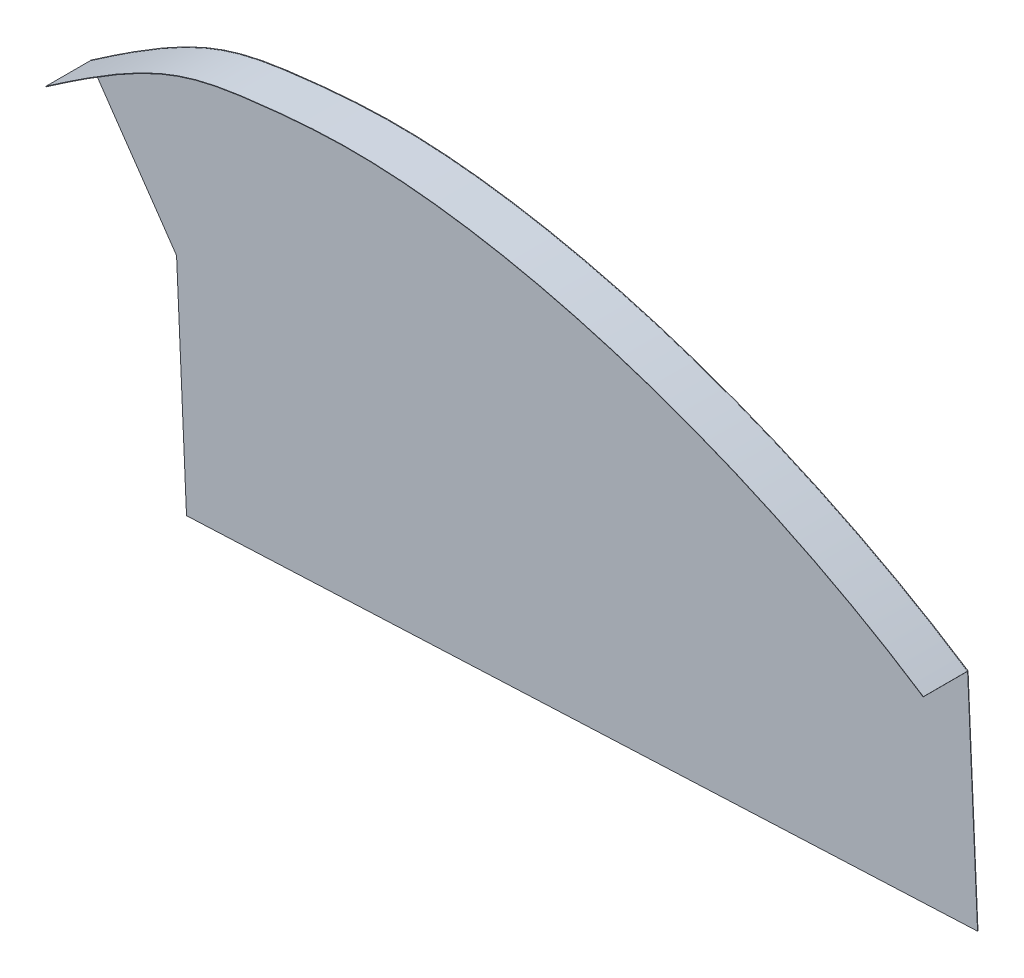
ISO-10303-21;
HEADER;
FILE_DESCRIPTION(('STEP AP214'),'2;1');
FILE_NAME('part.step','',(''),(''),'','','');
FILE_SCHEMA(('AUTOMOTIVE_DESIGN { 1 0 10303 214 1 1 1 1 }'));
ENDSEC;
DATA;
#1=APPLICATION_CONTEXT('core data for automotive mechanical design processes');
#2=APPLICATION_PROTOCOL_DEFINITION('international standard','automotive_design',2000,#1);
#3=PRODUCT_CONTEXT('',#1,'mechanical');
#4=PRODUCT('Part','Part','',(#3));
#5=PRODUCT_RELATED_PRODUCT_CATEGORY('part','',(#4));
#6=PRODUCT_DEFINITION_FORMATION('','',#4);
#7=PRODUCT_DEFINITION_CONTEXT('part definition',#1,'design');
#8=PRODUCT_DEFINITION('design','',#6,#7);
#9=PRODUCT_DEFINITION_SHAPE('','',#8);
#10=(LENGTH_UNIT() NAMED_UNIT(*) SI_UNIT(.MILLI.,.METRE.));
#11=(NAMED_UNIT(*) PLANE_ANGLE_UNIT() SI_UNIT($,.RADIAN.));
#12=(NAMED_UNIT(*) SI_UNIT($,.STERADIAN.) SOLID_ANGLE_UNIT());
#13=UNCERTAINTY_MEASURE_WITH_UNIT(LENGTH_MEASURE(1.E-05),#10,'distance_accuracy_value','');
#14=(GEOMETRIC_REPRESENTATION_CONTEXT(3) GLOBAL_UNCERTAINTY_ASSIGNED_CONTEXT((#13)) GLOBAL_UNIT_ASSIGNED_CONTEXT((#10,
#11,#12)) REPRESENTATION_CONTEXT('',''));
#15=CARTESIAN_POINT('',(0.,0.,0.));
#16=DIRECTION('',(0.,0.,1.));
#17=DIRECTION('',(1.,0.,0.));
#18=AXIS2_PLACEMENT_3D('',#15,#16,#17);
#19=CARTESIAN_POINT('',(-1544.64995665935,573.441433080312,0.1));
#20=CARTESIAN_POINT('',(-1585.71664888804,600.423930322912,0.1));
#21=CARTESIAN_POINT('',(-1646.28028973819,619.241808081414,0.1));
#22=CARTESIAN_POINT('',(-1709.38954114273,613.399774738818,0.1));
#23=CARTESIAN_POINT('',(-1719.50790421298,610.537812827554,0.1));
#24=CARTESIAN_POINT('',(-1743.60796018332,593.83047017767,0.1));
#25=B_SPLINE_CURVE_WITH_KNOTS('',3,(#19,#20,#21,#22,#23,#24),.UNSPECIFIED.,.F.,.F.,(4,1,1,4),
(0.,0.579445357910707,0.679445357910707,1.),.UNSPECIFIED.);
#26=DIRECTION('',(0.,0.,-1.));
#27=VECTOR('',#26,1.);
#28=SURFACE_OF_LINEAR_EXTRUSION('',#25,#27);
#29=CARTESIAN_POINT('',(-1544.64995665935,573.441433080312,0.));
#30=CARTESIAN_POINT('',(-1585.71664888804,600.423930322912,0.));
#31=CARTESIAN_POINT('',(-1646.28028973819,619.241808081414,0.));
#32=CARTESIAN_POINT('',(-1709.38954114273,613.399774738818,0.));
#33=CARTESIAN_POINT('',(-1719.50790421298,610.537812827554,0.));
#34=CARTESIAN_POINT('',(-1743.60796018332,593.83047017767,0.));
#35=B_SPLINE_CURVE_WITH_KNOTS('',3,(#29,#30,#31,#32,#33,#34),.UNSPECIFIED.,.F.,.F.,(4,1,1,4),
(0.,0.579445357910707,0.679445357910707,1.),.UNSPECIFIED.);
#36=CARTESIAN_POINT('',(-1544.64995665935,573.441433080312,0.));
#37=VERTEX_POINT('',#36);
#38=CARTESIAN_POINT('',(-1743.60796018332,593.83047017767,0.));
#39=VERTEX_POINT('',#38);
#40=EDGE_CURVE('E110',#37,#39,#35,.T.);
#41=ORIENTED_EDGE('',*,*,#40,.T.);
#42=DIRECTION('',(0.,0.,-1.));
#43=VECTOR('',#42,1.);
#44=CARTESIAN_POINT('',(-1743.60796018332,593.83047017767,0.1));
#45=LINE('',#44,#43);
#46=CARTESIAN_POINT('',(-1743.60796018332,593.83047017767,0.1));
#47=VERTEX_POINT('',#46);
#48=EDGE_CURVE('E11',#47,#39,#45,.T.);
#49=ORIENTED_EDGE('',*,*,#48,.F.);
#50=CARTESIAN_POINT('',(-1544.64995665935,573.441433080312,0.1));
#51=VERTEX_POINT('',#50);
#52=EDGE_CURVE('E191',#51,#47,#25,.T.);
#53=ORIENTED_EDGE('',*,*,#52,.F.);
#54=DIRECTION('',(0.,0.,-1.));
#55=VECTOR('',#54,1.);
#56=CARTESIAN_POINT('',(-1544.64995665935,573.441433080312,0.1));
#57=LINE('',#56,#55);
#58=EDGE_CURVE('E192',#51,#37,#57,.T.);
#59=ORIENTED_EDGE('',*,*,#58,.T.);
#60=EDGE_LOOP('',(#41,#49,#53,#59));
#61=FACE_BOUND('',#60,.T.);
#62=ADVANCED_FACE('F32',(#61),#28,.F.);
#63=CARTESIAN_POINT('',(-1743.60796018332,593.83047017767,0.1));
#64=DIRECTION('',(0.823299571310856,0.567607096396232,0.));
#65=DIRECTION('',(-0.567607096396232,0.823299571310856,0.));
#66=AXIS2_PLACEMENT_3D('',#63,#64,#65);
#67=PLANE('',#66);
#68=DIRECTION('',(0.567607096396232,-0.823299571310856,0.));
#69=VECTOR('',#68,1.);
#70=CARTESIAN_POINT('',(-1743.60796018332,593.83047017767,0.));
#71=LINE('',#70,#69);
#72=CARTESIAN_POINT('',(-1723.97557604015,565.354199265099,0.));
#73=VERTEX_POINT('',#72);
#74=EDGE_CURVE('E169',#39,#73,#71,.T.);
#75=ORIENTED_EDGE('',*,*,#74,.T.);
#76=DIRECTION('',(0.,0.,-1.));
#77=VECTOR('',#76,1.);
#78=CARTESIAN_POINT('',(-1723.97557604015,565.354199265099,0.1));
#79=LINE('',#78,#77);
#80=CARTESIAN_POINT('',(-1723.97557604015,565.354199265099,0.1));
#81=VERTEX_POINT('',#80);
#82=EDGE_CURVE('E40',#81,#73,#79,.T.);
#83=ORIENTED_EDGE('',*,*,#82,.F.);
#84=DIRECTION('',(0.567607096396232,-0.823299571310856,0.));
#85=VECTOR('',#84,1.);
#86=CARTESIAN_POINT('',(-1743.60796018332,593.83047017767,0.1));
#87=LINE('',#86,#85);
#88=EDGE_CURVE('E206',#47,#81,#87,.T.);
#89=ORIENTED_EDGE('',*,*,#88,.F.);
#90=ORIENTED_EDGE('',*,*,#48,.T.);
#91=EDGE_LOOP('',(#75,#83,#89,#90));
#92=FACE_BOUND('',#91,.T.);
#93=ADVANCED_FACE('F160',(#92),#67,.F.);
#94=CARTESIAN_POINT('',(-1723.97557604015,565.354199265099,0.1));
#95=DIRECTION('',(0.998984631984055,0.0450522481090854,0.));
#96=DIRECTION('',(-0.0450522481090854,0.998984631984055,0.));
#97=AXIS2_PLACEMENT_3D('',#94,#95,#96);
#98=PLANE('',#97);
#99=DIRECTION('',(0.0450522481090854,-0.998984631984055,0.));
#100=VECTOR('',#99,1.);
#101=CARTESIAN_POINT('',(-1723.97557604015,565.354199265099,0.));
#102=LINE('',#101,#100);
#103=CARTESIAN_POINT('',(-1721.7229636347,515.404967665896,0.));
#104=VERTEX_POINT('',#103);
#105=EDGE_CURVE('E176',#73,#104,#102,.T.);
#106=ORIENTED_EDGE('',*,*,#105,.T.);
#107=DIRECTION('',(0.,0.,-1.));
#108=VECTOR('',#107,1.);
#109=CARTESIAN_POINT('',(-1721.7229636347,515.404967665896,0.1));
#110=LINE('',#109,#108);
#111=CARTESIAN_POINT('',(-1721.7229636347,515.404967665896,0.1));
#112=VERTEX_POINT('',#111);
#113=EDGE_CURVE('E181',#112,#104,#110,.T.);
#114=ORIENTED_EDGE('',*,*,#113,.F.);
#115=DIRECTION('',(0.0450522481090854,-0.998984631984055,0.));
#116=VECTOR('',#115,1.);
#117=CARTESIAN_POINT('',(-1723.97557604015,565.354199265099,0.1));
#118=LINE('',#117,#116);
#119=EDGE_CURVE('E180',#81,#112,#118,.T.);
#120=ORIENTED_EDGE('',*,*,#119,.F.);
#121=ORIENTED_EDGE('',*,*,#82,.T.);
#122=EDGE_LOOP('',(#106,#114,#120,#121));
#123=FACE_BOUND('',#122,.T.);
#124=ADVANCED_FACE('F157',(#123),#98,.F.);
#125=CARTESIAN_POINT('',(-1542.39734425389,523.492201481109,0.1));
#126=DIRECTION('',(-0.0450522481090856,0.998984631984055,0.));
#127=DIRECTION('',(-0.998984631984055,-0.0450522481090857,0.));
#128=AXIS2_PLACEMENT_3D('',#125,#126,#127);
#129=PLANE('',#128);
#130=DIRECTION('',(0.998984631984055,0.0450522481090856,0.));
#131=VECTOR('',#130,1.);
#132=CARTESIAN_POINT('',(-1542.39734425389,523.492201481109,0.));
#133=LINE('',#132,#131);
#134=CARTESIAN_POINT('',(-1542.39734425389,523.492201481109,0.));
#135=VERTEX_POINT('',#134);
#136=EDGE_CURVE('E184',#104,#135,#133,.T.);
#137=ORIENTED_EDGE('',*,*,#136,.T.);
#138=DIRECTION('',(0.,0.,-1.));
#139=VECTOR('',#138,1.);
#140=CARTESIAN_POINT('',(-1542.39734425389,523.492201481109,0.1));
#141=LINE('',#140,#139);
#142=CARTESIAN_POINT('',(-1542.39734425389,523.492201481109,0.1));
#143=VERTEX_POINT('',#142);
#144=EDGE_CURVE('E195',#143,#135,#141,.T.);
#145=ORIENTED_EDGE('',*,*,#144,.F.);
#146=DIRECTION('',(0.998984631984055,0.0450522481090856,0.));
#147=VECTOR('',#146,1.);
#148=CARTESIAN_POINT('',(-1542.39734425389,523.492201481109,0.1));
#149=LINE('',#148,#147);
#150=EDGE_CURVE('E201',#112,#143,#149,.T.);
#151=ORIENTED_EDGE('',*,*,#150,.F.);
#152=ORIENTED_EDGE('',*,*,#113,.T.);
#153=EDGE_LOOP('',(#137,#145,#151,#152));
#154=FACE_BOUND('',#153,.T.);
#155=ADVANCED_FACE('F153',(#154),#129,.F.);
#156=CARTESIAN_POINT('',(-1544.64995665935,573.441433080312,0.1));
#157=DIRECTION('',(-0.998984631984055,-0.0450522481090854,0.));
#158=DIRECTION('',(0.0450522481090854,-0.998984631984055,0.));
#159=AXIS2_PLACEMENT_3D('',#156,#157,#158);
#160=PLANE('',#159);
#161=DIRECTION('',(-0.0450522481090854,0.998984631984055,0.));
#162=VECTOR('',#161,1.);
#163=CARTESIAN_POINT('',(-1544.64995665935,573.441433080312,0.));
#164=LINE('',#163,#162);
#165=EDGE_CURVE('E186',#135,#37,#164,.T.);
#166=ORIENTED_EDGE('',*,*,#165,.T.);
#167=ORIENTED_EDGE('',*,*,#58,.F.);
#168=DIRECTION('',(-0.0450522481090854,0.998984631984055,0.));
#169=VECTOR('',#168,1.);
#170=CARTESIAN_POINT('',(-1544.64995665935,573.441433080312,0.1));
#171=LINE('',#170,#169);
#172=EDGE_CURVE('E196',#143,#51,#171,.T.);
#173=ORIENTED_EDGE('',*,*,#172,.F.);
#174=ORIENTED_EDGE('',*,*,#144,.T.);
#175=EDGE_LOOP('',(#166,#167,#173,#174));
#176=FACE_BOUND('',#175,.T.);
#177=ADVANCED_FACE('F147',(#176),#160,.F.);
#178=CARTESIAN_POINT('',(-1659.53553734202,615.24308702669,0.1));
#179=DIRECTION('',(0.,0.,1.));
#180=DIRECTION('',(1.,0.,0.));
#181=AXIS2_PLACEMENT_3D('',#178,#179,#180);
#182=PLANE('',#181);
#183=DIRECTION('',(-0.549118385868169,-0.835744577189428,0.));
#184=VECTOR('',#183,1.);
#185=CARTESIAN_POINT('',(-1342.05540629883,881.785318824068,0.1));
#186=LINE('',#185,#184);
#187=CARTESIAN_POINT('',(-1544.67741257864,573.399645851452,0.0999999999999994));
#188=VERTEX_POINT('',#187);
#189=CARTESIAN_POINT('',(-1544.73232441723,573.316071393733,0.1));
#190=VERTEX_POINT('',#189);
#191=EDGE_CURVE('E108',#188,#190,#186,.T.);
#192=ORIENTED_EDGE('',*,*,#191,.T.);
#193=CARTESIAN_POINT('',(-1544.73232441723,573.316071393733,0.1));
#194=CARTESIAN_POINT('',(-1546.9519488348,574.774455463074,0.1));
#195=CARTESIAN_POINT('',(-1551.43127800974,577.613556033188,0.1));
#196=CARTESIAN_POINT('',(-1560.62942944249,583.045346230826,0.1));
#197=CARTESIAN_POINT('',(-1572.47093595197,589.326889692186,0.1));
#198=CARTESIAN_POINT('',(-1587.0698673746,596.019330748109,0.1));
#199=CARTESIAN_POINT('',(-1606.81265126061,603.755089395571,0.1));
#200=CARTESIAN_POINT('',(-1626.62090438922,609.625271880809,0.1));
#201=CARTESIAN_POINT('',(-1645.78545252912,613.461587482119,0.1));
#202=CARTESIAN_POINT('',(-1659.66402273344,615.275078476153,0.1));
#203=CARTESIAN_POINT('',(-1672.85543086534,616.000525973034,0.1));
#204=CARTESIAN_POINT('',(-1683.17584633953,615.607177852822,0.1));
#205=CARTESIAN_POINT('',(-1690.71915152159,614.940047919185,0.1));
#206=CARTESIAN_POINT('',(-1697.61941057258,614.184343592506,0.1));
#207=CARTESIAN_POINT('',(-1704.94143994043,613.175751133432,0.1));
#208=CARTESIAN_POINT('',(-1711.53706287152,611.5205858769,0.1));
#209=CARTESIAN_POINT('',(-1716.95073175608,609.496349747706,0.1));
#210=CARTESIAN_POINT('',(-1721.22633977372,607.547139739651,0.1));
#211=CARTESIAN_POINT('',(-1725.86182003669,605.087085053395,0.1));
#212=CARTESIAN_POINT('',(-1730.14437771435,602.544994912,0.1));
#213=CARTESIAN_POINT('',(-1733.8948142354,600.175895508009,0.1));
#214=CARTESIAN_POINT('',(-1736.8860842667,598.222624563629,0.1));
#215=CARTESIAN_POINT('',(-1739.54836201676,596.435520579365,0.1));
#216=CARTESIAN_POINT('',(-1741.77568270842,594.914415574359,0.1));
#217=CARTESIAN_POINT('',(-1742.94582133205,594.106977841768,0.1));
#218=CARTESIAN_POINT('',(-1743.52250025105,593.707195687292,0.1));
#219=B_SPLINE_CURVE_WITH_KNOTS('',3,(#193,#194,#195,#196,#197,#198,#199,#200,#201,#202,#203,
#204,#205,#206,#207,#208,#209,#210,#211,#212,#213,#214,#215,#216,#217,#218),.UNSPECIFIED.,.F.,
.F.,(4,1,1,1,1,1,1,1,1,1,1,1,1,1,1,1,1,1,1,1,1,1,1,4),(0.,0.03125,0.0625,0.125,0.1875,0.25,
0.375,0.4375,0.5,0.5625,0.625,0.65625,0.6875,0.75,0.8125,0.84375,0.875,0.90625,0.9375,0.953125,
0.96875,0.984375,0.9921875,1.),.UNSPECIFIED.);
#220=CARTESIAN_POINT('',(-1743.52250025105,593.707195687292,0.0999999999999977));
#221=VERTEX_POINT('',#220);
#222=EDGE_CURVE('E124',#190,#221,#219,.T.);
#223=ORIENTED_EDGE('',*,*,#222,.T.);
#224=DIRECTION('',(0.569732881743784,-0.821829935850431,0.));
#225=VECTOR('',#224,1.);
#226=CARTESIAN_POINT('',(-899.595160445761,-623.643555443328,0.1));
#227=LINE('',#226,#225);
#228=CARTESIAN_POINT('',(-1743.57947353923,593.789378680877,0.1));
#229=VERTEX_POINT('',#228);
#230=EDGE_CURVE('E52',#229,#221,#227,.T.);
#231=ORIENTED_EDGE('',*,*,#230,.F.);
#232=CARTESIAN_POINT('',(-1544.67741257864,573.399645851452,0.1));
#233=CARTESIAN_POINT('',(-1580.10630688182,596.677879158398,0.1));
#234=CARTESIAN_POINT('',(-1623.41727661125,611.817205851016,0.1));
#235=CARTESIAN_POINT('',(-1664.05555432562,615.615316248625,0.1));
#236=CARTESIAN_POINT('',(-1668.45858748525,615.853546331745,0.1));
#237=CARTESIAN_POINT('',(-1674.85045688565,615.924640205925,0.1));
#238=CARTESIAN_POINT('',(-1676.94707234617,615.898899542227,0.1));
#239=CARTESIAN_POINT('',(-1681.053950245,615.760083503958,0.1));
#240=CARTESIAN_POINT('',(-1685.070934683,615.538033819222,0.1));
#241=CARTESIAN_POINT('',(-1688.84153528557,615.206941308899,0.1));
#242=CARTESIAN_POINT('',(-1692.45566082211,614.850042830177,0.1));
#243=CARTESIAN_POINT('',(-1694.1825533992,614.660043123166,0.1));
#244=CARTESIAN_POINT('',(-1699.09217730466,614.084892782621,0.1));
#245=CARTESIAN_POINT('',(-1702.0267403375,613.678931578794,0.1));
#246=CARTESIAN_POINT('',(-1710.3914540648,612.076086015253,0.1));
#247=CARTESIAN_POINT('',(-1715.38281240301,610.494610735516,0.1));
#248=CARTESIAN_POINT('',(-1727.27852043395,604.608644100186,0.1));
#249=CARTESIAN_POINT('',(-1734.18262553921,600.30373530969,0.1));
#250=CARTESIAN_POINT('',(-1743.57947353923,593.789378680877,0.1));
#251=B_SPLINE_CURVE_WITH_KNOTS('',3,(#232,#233,#234,#235,#236,#237,#238,#239,#240,#241,#242,
#243,#244,#245,#246,#247,#248,#249,#250),.UNSPECIFIED.,.F.,.F.,(4,2,2,2,1,2,2,2,2,4),(0.,
0.499999999999989,0.562499999999988,0.593749999999988,0.624999999999989,0.65624999999999,
0.687499999999991,0.749999999999993,0.874999999999996,1.),.UNSPECIFIED.);
#252=EDGE_CURVE('E47',#188,#229,#251,.T.);
#253=ORIENTED_EDGE('',*,*,#252,.F.);
#254=EDGE_LOOP('',(#192,#223,#231,#253));
#255=FACE_BOUND('',#254,.T.);
#256=ORIENTED_EDGE('',*,*,#52,.T.);
#257=ORIENTED_EDGE('',*,*,#88,.T.);
#258=ORIENTED_EDGE('',*,*,#119,.T.);
#259=ORIENTED_EDGE('',*,*,#150,.T.);
#260=ORIENTED_EDGE('',*,*,#172,.T.);
#261=EDGE_LOOP('',(#256,#257,#258,#259,#260));
#262=FACE_BOUND('',#261,.T.);
#263=ADVANCED_FACE('F144',(#255,#262),#182,.T.);
#264=CARTESIAN_POINT('',(-1659.53553734202,615.24308702669,0.));
#265=DIRECTION('',(0.,0.,1.));
#266=DIRECTION('',(1.,0.,0.));
#267=AXIS2_PLACEMENT_3D('',#264,#265,#266);
#268=PLANE('',#267);
#269=ORIENTED_EDGE('',*,*,#40,.F.);
#270=ORIENTED_EDGE('',*,*,#165,.F.);
#271=ORIENTED_EDGE('',*,*,#136,.F.);
#272=ORIENTED_EDGE('',*,*,#105,.F.);
#273=ORIENTED_EDGE('',*,*,#74,.F.);
#274=EDGE_LOOP('',(#269,#270,#271,#272,#273));
#275=FACE_BOUND('',#274,.T.);
#276=ADVANCED_FACE('F143',(#275),#268,.F.);
#277=CARTESIAN_POINT('',(-1342.05540629883,881.785318824068,10.1));
#278=DIRECTION('',(0.835744577189428,-0.549118385868169,0.));
#279=DIRECTION('',(0.549118385868169,0.835744577189428,0.));
#280=AXIS2_PLACEMENT_3D('',#277,#278,#279);
#281=PLANE('',#280);
#282=ORIENTED_EDGE('',*,*,#191,.F.);
#283=DIRECTION('',(0.,0.,-1.));
#284=VECTOR('',#283,1.);
#285=CARTESIAN_POINT('',(-1544.67741257864,573.399645851452,10.1));
#286=LINE('',#285,#284);
#287=CARTESIAN_POINT('',(-1544.67741257864,573.399645851452,10.1));
#288=VERTEX_POINT('',#287);
#289=EDGE_CURVE('E101',#288,#188,#286,.T.);
#290=ORIENTED_EDGE('',*,*,#289,.F.);
#291=DIRECTION('',(-0.549118385868169,-0.835744577189428,0.));
#292=VECTOR('',#291,1.);
#293=CARTESIAN_POINT('',(-1342.05540629883,881.785318824068,10.1));
#294=LINE('',#293,#292);
#295=CARTESIAN_POINT('',(-1544.73232441723,573.316071393733,10.1));
#296=VERTEX_POINT('',#295);
#297=EDGE_CURVE('E106',#288,#296,#294,.T.);
#298=ORIENTED_EDGE('',*,*,#297,.T.);
#299=DIRECTION('',(0.,0.,-1.));
#300=VECTOR('',#299,1.);
#301=CARTESIAN_POINT('',(-1544.73232441723,573.316071393733,10.1));
#302=LINE('',#301,#300);
#303=EDGE_CURVE('E228',#296,#190,#302,.T.);
#304=ORIENTED_EDGE('',*,*,#303,.T.);
#305=EDGE_LOOP('',(#282,#290,#298,#304));
#306=FACE_BOUND('',#305,.T.);
#307=ADVANCED_FACE('F103',(#306),#281,.T.);
#308=CARTESIAN_POINT('',(-1544.67741257864,573.399645851452,10.1));
#309=CARTESIAN_POINT('',(-1580.10630688182,596.677879158398,10.1));
#310=CARTESIAN_POINT('',(-1623.41727661125,611.817205851016,10.1));
#311=CARTESIAN_POINT('',(-1664.05555432562,615.615316248625,10.1));
#312=CARTESIAN_POINT('',(-1668.45858748525,615.853546331745,10.1));
#313=CARTESIAN_POINT('',(-1674.85045688565,615.924640205925,10.1));
#314=CARTESIAN_POINT('',(-1676.94707234617,615.898899542227,10.1));
#315=CARTESIAN_POINT('',(-1681.053950245,615.760083503958,10.1));
#316=CARTESIAN_POINT('',(-1685.070934683,615.538033819222,10.1));
#317=CARTESIAN_POINT('',(-1688.84153528557,615.206941308899,10.1));
#318=CARTESIAN_POINT('',(-1692.45566082211,614.850042830177,10.1));
#319=CARTESIAN_POINT('',(-1694.1825533992,614.660043123166,10.1));
#320=CARTESIAN_POINT('',(-1699.09217730466,614.084892782621,10.1));
#321=CARTESIAN_POINT('',(-1702.0267403375,613.678931578794,10.1));
#322=CARTESIAN_POINT('',(-1710.3914540648,612.076086015253,10.1));
#323=CARTESIAN_POINT('',(-1715.38281240301,610.494610735516,10.1));
#324=CARTESIAN_POINT('',(-1727.27852043395,604.608644100186,10.1));
#325=CARTESIAN_POINT('',(-1734.18262553921,600.30373530969,10.1));
#326=CARTESIAN_POINT('',(-1743.57947353923,593.789378680877,10.1));
#327=B_SPLINE_CURVE_WITH_KNOTS('',3,(#308,#309,#310,#311,#312,#313,#314,#315,#316,#317,#318,
#319,#320,#321,#322,#323,#324,#325,#326),.UNSPECIFIED.,.F.,.F.,(4,2,2,2,1,2,2,2,2,4),(0.,
0.499999999999989,0.562499999999988,0.593749999999988,0.624999999999989,0.65624999999999,
0.687499999999991,0.749999999999993,0.874999999999996,1.),.UNSPECIFIED.);
#328=DIRECTION('',(0.,0.,-1.));
#329=VECTOR('',#328,1.);
#330=SURFACE_OF_LINEAR_EXTRUSION('',#327,#329);
#331=ORIENTED_EDGE('',*,*,#252,.T.);
#332=DIRECTION('',(0.,0.,-1.));
#333=VECTOR('',#332,1.);
#334=CARTESIAN_POINT('',(-1743.57947353923,593.789378680877,10.1));
#335=LINE('',#334,#333);
#336=CARTESIAN_POINT('',(-1743.57947353923,593.789378680877,10.1));
#337=VERTEX_POINT('',#336);
#338=EDGE_CURVE('E111',#337,#229,#335,.T.);
#339=ORIENTED_EDGE('',*,*,#338,.F.);
#340=EDGE_CURVE('E114',#288,#337,#327,.T.);
#341=ORIENTED_EDGE('',*,*,#340,.F.);
#342=ORIENTED_EDGE('',*,*,#289,.T.);
#343=EDGE_LOOP('',(#331,#339,#341,#342));
#344=FACE_BOUND('',#343,.T.);
#345=ADVANCED_FACE('F115',(#344),#330,.F.);
#346=CARTESIAN_POINT('',(-899.595160445761,-623.643555443328,10.1));
#347=DIRECTION('',(0.821829935850431,0.569732881743784,0.));
#348=DIRECTION('',(-0.569732881743784,0.821829935850431,0.));
#349=AXIS2_PLACEMENT_3D('',#346,#347,#348);
#350=PLANE('',#349);
#351=ORIENTED_EDGE('',*,*,#230,.T.);
#352=DIRECTION('',(0.,0.,-1.));
#353=VECTOR('',#352,1.);
#354=CARTESIAN_POINT('',(-1743.52250025105,593.707195687292,10.1));
#355=LINE('',#354,#353);
#356=CARTESIAN_POINT('',(-1743.52250025105,593.707195687292,10.1));
#357=VERTEX_POINT('',#356);
#358=EDGE_CURVE('E225',#357,#221,#355,.T.);
#359=ORIENTED_EDGE('',*,*,#358,.F.);
#360=DIRECTION('',(0.569732881743784,-0.821829935850431,0.));
#361=VECTOR('',#360,1.);
#362=CARTESIAN_POINT('',(-899.595160445761,-623.643555443328,10.1));
#363=LINE('',#362,#361);
#364=EDGE_CURVE('E119',#337,#357,#363,.T.);
#365=ORIENTED_EDGE('',*,*,#364,.F.);
#366=ORIENTED_EDGE('',*,*,#338,.T.);
#367=EDGE_LOOP('',(#351,#359,#365,#366));
#368=FACE_BOUND('',#367,.T.);
#369=ADVANCED_FACE('F139',(#368),#350,.F.);
#370=CARTESIAN_POINT('',(-1544.73232441723,573.316071393733,10.1));
#371=CARTESIAN_POINT('',(-1546.9519488348,574.774455463074,10.1));
#372=CARTESIAN_POINT('',(-1551.43127800974,577.613556033188,10.1));
#373=CARTESIAN_POINT('',(-1560.62942944249,583.045346230826,10.1));
#374=CARTESIAN_POINT('',(-1572.47093595197,589.326889692186,10.1));
#375=CARTESIAN_POINT('',(-1587.0698673746,596.019330748109,10.1));
#376=CARTESIAN_POINT('',(-1606.81265126061,603.755089395571,10.1));
#377=CARTESIAN_POINT('',(-1626.62090438922,609.625271880809,10.1));
#378=CARTESIAN_POINT('',(-1645.78545252912,613.461587482119,10.1));
#379=CARTESIAN_POINT('',(-1659.66402273344,615.275078476153,10.1));
#380=CARTESIAN_POINT('',(-1672.85543086534,616.000525973034,10.1));
#381=CARTESIAN_POINT('',(-1683.17584633953,615.607177852822,10.1));
#382=CARTESIAN_POINT('',(-1690.71915152159,614.940047919185,10.1));
#383=CARTESIAN_POINT('',(-1697.61941057258,614.184343592506,10.1));
#384=CARTESIAN_POINT('',(-1704.94143994043,613.175751133432,10.1));
#385=CARTESIAN_POINT('',(-1711.53706287152,611.5205858769,10.1));
#386=CARTESIAN_POINT('',(-1716.95073175608,609.496349747706,10.1));
#387=CARTESIAN_POINT('',(-1721.22633977372,607.547139739651,10.1));
#388=CARTESIAN_POINT('',(-1725.86182003669,605.087085053395,10.1));
#389=CARTESIAN_POINT('',(-1730.14437771435,602.544994912,10.1));
#390=CARTESIAN_POINT('',(-1733.8948142354,600.175895508009,10.1));
#391=CARTESIAN_POINT('',(-1736.8860842667,598.222624563629,10.1));
#392=CARTESIAN_POINT('',(-1739.54836201676,596.435520579365,10.1));
#393=CARTESIAN_POINT('',(-1741.77568270842,594.914415574359,10.1));
#394=CARTESIAN_POINT('',(-1742.94582133205,594.106977841768,10.1));
#395=CARTESIAN_POINT('',(-1743.52250025105,593.707195687292,10.1));
#396=B_SPLINE_CURVE_WITH_KNOTS('',3,(#370,#371,#372,#373,#374,#375,#376,#377,#378,#379,#380,
#381,#382,#383,#384,#385,#386,#387,#388,#389,#390,#391,#392,#393,#394,#395),.UNSPECIFIED.,.F.,
.F.,(4,1,1,1,1,1,1,1,1,1,1,1,1,1,1,1,1,1,1,1,1,1,1,4),(0.,0.03125,0.0625,0.125,0.1875,0.25,
0.375,0.4375,0.5,0.5625,0.625,0.65625,0.6875,0.75,0.8125,0.84375,0.875,0.90625,0.9375,0.953125,
0.96875,0.984375,0.9921875,1.),.UNSPECIFIED.);
#397=DIRECTION('',(0.,0.,-1.));
#398=VECTOR('',#397,1.);
#399=SURFACE_OF_LINEAR_EXTRUSION('',#396,#398);
#400=ORIENTED_EDGE('',*,*,#222,.F.);
#401=ORIENTED_EDGE('',*,*,#303,.F.);
#402=EDGE_CURVE('E123',#296,#357,#396,.T.);
#403=ORIENTED_EDGE('',*,*,#402,.T.);
#404=ORIENTED_EDGE('',*,*,#358,.T.);
#405=EDGE_LOOP('',(#400,#401,#403,#404));
#406=FACE_BOUND('',#405,.T.);
#407=ADVANCED_FACE('F248',(#406),#399,.T.);
#408=CARTESIAN_POINT('',(0.,0.,10.1));
#409=DIRECTION('',(0.,0.,1.));
#410=DIRECTION('',(1.,0.,0.));
#411=AXIS2_PLACEMENT_3D('',#408,#409,#410);
#412=PLANE('',#411);
#413=ORIENTED_EDGE('',*,*,#297,.F.);
#414=ORIENTED_EDGE('',*,*,#340,.T.);
#415=ORIENTED_EDGE('',*,*,#364,.T.);
#416=ORIENTED_EDGE('',*,*,#402,.F.);
#417=EDGE_LOOP('',(#413,#414,#415,#416));
#418=FACE_BOUND('',#417,.T.);
#419=ADVANCED_FACE('F121',(#418),#412,.T.);
#420=CLOSED_SHELL('',(#62,#93,#124,#155,#177,#263,#276,#307,#345,#369,#407,#419));
#421=MANIFOLD_SOLID_BREP('B2',#420);
#422=ADVANCED_BREP_SHAPE_REPRESENTATION('',(#18,#421),#14);
#423=SHAPE_DEFINITION_REPRESENTATION(#9,#422);
ENDSEC;
END-ISO-10303-21;
